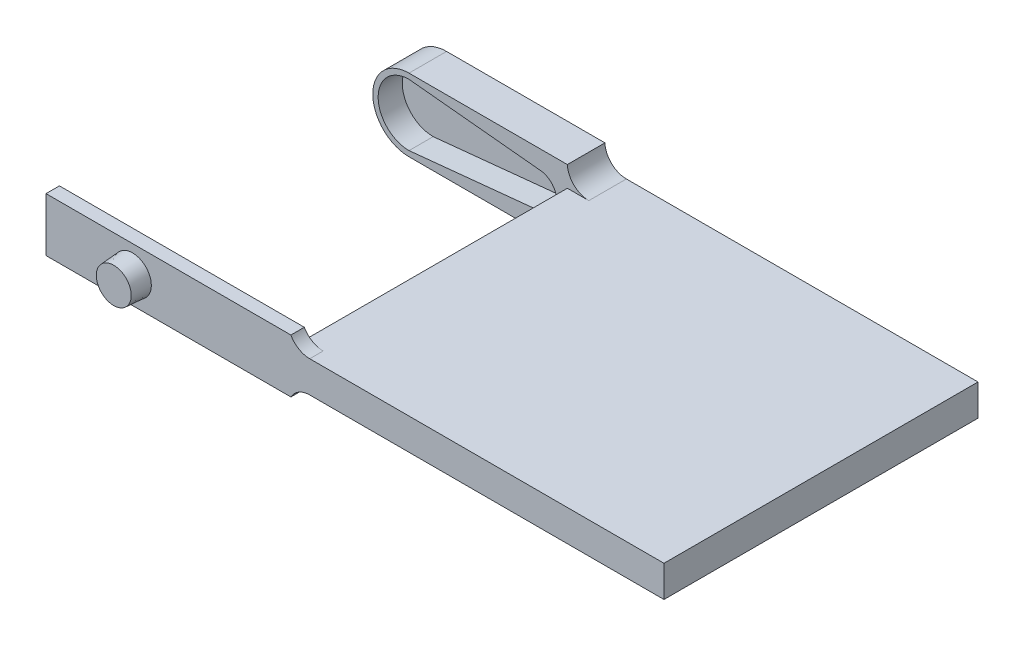
ISO-10303-21;
HEADER;
FILE_DESCRIPTION(('STEP AP214'),'2;1');
FILE_NAME('part.step','',(''),(''),'','','');
FILE_SCHEMA(('AUTOMOTIVE_DESIGN { 1 0 10303 214 1 1 1 1 }'));
ENDSEC;
DATA;
#1=APPLICATION_CONTEXT('core data for automotive mechanical design processes');
#2=APPLICATION_PROTOCOL_DEFINITION('international standard','automotive_design',2000,#1);
#3=PRODUCT_CONTEXT('',#1,'mechanical');
#4=PRODUCT('Part','Part','',(#3));
#5=PRODUCT_RELATED_PRODUCT_CATEGORY('part','',(#4));
#6=PRODUCT_DEFINITION_FORMATION('','',#4);
#7=PRODUCT_DEFINITION_CONTEXT('part definition',#1,'design');
#8=PRODUCT_DEFINITION('design','',#6,#7);
#9=PRODUCT_DEFINITION_SHAPE('','',#8);
#10=(LENGTH_UNIT() NAMED_UNIT(*) SI_UNIT(.MILLI.,.METRE.));
#11=(NAMED_UNIT(*) PLANE_ANGLE_UNIT() SI_UNIT($,.RADIAN.));
#12=(NAMED_UNIT(*) SI_UNIT($,.STERADIAN.) SOLID_ANGLE_UNIT());
#13=UNCERTAINTY_MEASURE_WITH_UNIT(LENGTH_MEASURE(1.E-05),#10,'distance_accuracy_value','');
#14=(GEOMETRIC_REPRESENTATION_CONTEXT(3) GLOBAL_UNCERTAINTY_ASSIGNED_CONTEXT((#13)) GLOBAL_UNIT_ASSIGNED_CONTEXT((#10,
#11,#12)) REPRESENTATION_CONTEXT('',''));
#15=CARTESIAN_POINT('',(0.,0.,0.));
#16=DIRECTION('',(0.,0.,1.));
#17=DIRECTION('',(1.,0.,0.));
#18=AXIS2_PLACEMENT_3D('',#15,#16,#17);
#19=CARTESIAN_POINT('',(0.,0.,29.25));
#20=DIRECTION('',(0.,0.,-1.));
#21=DIRECTION('',(-1.,0.,0.));
#22=AXIS2_PLACEMENT_3D('',#19,#20,#21);
#23=PLANE('',#22);
#24=DIRECTION('',(-1.,0.,0.));
#25=VECTOR('',#24,1.);
#26=CARTESIAN_POINT('',(0.,4.83707186120483,29.25));
#27=LINE('',#26,#25);
#28=CARTESIAN_POINT('',(49.5,4.83707186120483,29.25));
#29=VERTEX_POINT('',#28);
#30=CARTESIAN_POINT('',(16.5034017605437,4.83707186120483,29.25));
#31=VERTEX_POINT('',#30);
#32=EDGE_CURVE('E244',#29,#31,#27,.T.);
#33=ORIENTED_EDGE('',*,*,#32,.T.);
#34=CARTESIAN_POINT('',(16.5034017605437,6.83707186120483,29.25));
#35=DIRECTION('',(0.,0.,-1.));
#36=DIRECTION('',(-1.,0.,0.));
#37=AXIS2_PLACEMENT_3D('',#34,#35,#36);
#38=CIRCLE('',#37,2.);
#39=CARTESIAN_POINT('',(14.75,5.875,29.25));
#40=VERTEX_POINT('',#39);
#41=EDGE_CURVE('E12',#31,#40,#38,.T.);
#42=ORIENTED_EDGE('',*,*,#41,.T.);
#43=DIRECTION('',(-1.,0.,0.));
#44=VECTOR('',#43,1.);
#45=CARTESIAN_POINT('',(13.5,5.875,29.25));
#46=LINE('',#45,#44);
#47=CARTESIAN_POINT('',(-8.06135668366892,5.875,29.25));
#48=VERTEX_POINT('',#47);
#49=EDGE_CURVE('E227',#40,#48,#46,.T.);
#50=ORIENTED_EDGE('',*,*,#49,.T.);
#51=DIRECTION('',(0.,-1.,0.));
#52=VECTOR('',#51,1.);
#53=CARTESIAN_POINT('',(-8.06135668366892,5.875,29.25));
#54=LINE('',#53,#52);
#55=CARTESIAN_POINT('',(-8.06135668366892,0.875000000000004,29.25));
#56=VERTEX_POINT('',#55);
#57=EDGE_CURVE('E713',#48,#56,#54,.T.);
#58=ORIENTED_EDGE('',*,*,#57,.T.);
#59=DIRECTION('',(-1.,0.,0.));
#60=VECTOR('',#59,1.);
#61=CARTESIAN_POINT('',(14.75,0.875000000000004,29.25));
#62=LINE('',#61,#60);
#63=CARTESIAN_POINT('',(14.75,0.875000000000004,29.25));
#64=VERTEX_POINT('',#63);
#65=EDGE_CURVE('E386',#64,#56,#62,.T.);
#66=ORIENTED_EDGE('',*,*,#65,.F.);
#67=CARTESIAN_POINT('',(16.5034017605437,-0.0870718612048299,29.25));
#68=DIRECTION('',(0.,0.,-1.));
#69=DIRECTION('',(-1.,0.,0.));
#70=AXIS2_PLACEMENT_3D('',#67,#68,#69);
#71=CIRCLE('',#70,2.);
#72=CARTESIAN_POINT('',(16.5034017605437,1.91292813879517,29.25));
#73=VERTEX_POINT('',#72);
#74=EDGE_CURVE('E218',#64,#73,#71,.T.);
#75=ORIENTED_EDGE('',*,*,#74,.T.);
#76=DIRECTION('',(-1.,0.,0.));
#77=VECTOR('',#76,1.);
#78=CARTESIAN_POINT('',(0.,1.91292813879517,29.25));
#79=LINE('',#78,#77);
#80=CARTESIAN_POINT('',(49.5,1.91292813879517,29.25));
#81=VERTEX_POINT('',#80);
#82=EDGE_CURVE('E241',#81,#73,#79,.T.);
#83=ORIENTED_EDGE('',*,*,#82,.F.);
#84=DIRECTION('',(0.,1.,0.));
#85=VECTOR('',#84,1.);
#86=CARTESIAN_POINT('',(49.5,0.,29.25));
#87=LINE('',#86,#85);
#88=EDGE_CURVE('E248',#81,#29,#87,.T.);
#89=ORIENTED_EDGE('',*,*,#88,.T.);
#90=EDGE_LOOP('',(#33,#42,#50,#58,#66,#75,#83,#89));
#91=FACE_BOUND('',#90,.T.);
#92=CARTESIAN_POINT('',(0.,3.375,29.25));
#93=DIRECTION('',(0.,0.,-1.));
#94=DIRECTION('',(-1.,0.,0.));
#95=AXIS2_PLACEMENT_3D('',#92,#93,#94);
#96=CIRCLE('',#95,1.75);
#97=CARTESIAN_POINT('',(-1.75,3.375,29.25));
#98=VERTEX_POINT('',#97);
#99=EDGE_CURVE('E343',#98,#98,#96,.F.);
#100=ORIENTED_EDGE('',*,*,#99,.F.);
#101=EDGE_LOOP('',(#100));
#102=FACE_BOUND('',#101,.T.);
#103=ADVANCED_FACE('F57',(#91,#102),#23,.F.);
#104=CARTESIAN_POINT('',(0.,6.75,3.5));
#105=DIRECTION('',(0.,1.,0.));
#106=DIRECTION('',(0.,0.,1.));
#107=AXIS2_PLACEMENT_3D('',#104,#105,#106);
#108=PLANE('',#107);
#109=DIRECTION('',(1.,0.,0.));
#110=VECTOR('',#109,1.);
#111=CARTESIAN_POINT('',(0.,6.75,0.));
#112=LINE('',#111,#110);
#113=CARTESIAN_POINT('',(0.,6.75,0.));
#114=VERTEX_POINT('',#113);
#115=CARTESIAN_POINT('',(14.75,6.75,0.));
#116=VERTEX_POINT('',#115);
#117=EDGE_CURVE('E323',#114,#116,#112,.T.);
#118=ORIENTED_EDGE('',*,*,#117,.F.);
#119=DIRECTION('',(0.,0.,-1.));
#120=VECTOR('',#119,1.);
#121=CARTESIAN_POINT('',(0.,6.75,3.5));
#122=LINE('',#121,#120);
#123=CARTESIAN_POINT('',(0.,6.75,3.5));
#124=VERTEX_POINT('',#123);
#125=EDGE_CURVE('E341',#124,#114,#122,.T.);
#126=ORIENTED_EDGE('',*,*,#125,.F.);
#127=DIRECTION('',(1.,0.,0.));
#128=VECTOR('',#127,1.);
#129=CARTESIAN_POINT('',(0.,6.75,3.5));
#130=LINE('',#129,#128);
#131=CARTESIAN_POINT('',(14.75,6.75,3.5));
#132=VERTEX_POINT('',#131);
#133=EDGE_CURVE('E308',#124,#132,#130,.T.);
#134=ORIENTED_EDGE('',*,*,#133,.T.);
#135=DIRECTION('',(0.,0.,-1.));
#136=VECTOR('',#135,1.);
#137=CARTESIAN_POINT('',(14.75,6.75,3.5));
#138=LINE('',#137,#136);
#139=EDGE_CURVE('E331',#132,#116,#138,.T.);
#140=ORIENTED_EDGE('',*,*,#139,.T.);
#141=EDGE_LOOP('',(#118,#126,#134,#140));
#142=FACE_BOUND('',#141,.T.);
#143=ADVANCED_FACE('F406',(#142),#108,.T.);
#144=CARTESIAN_POINT('',(0.,3.375,3.5));
#145=DIRECTION('',(0.,0.,-1.));
#146=DIRECTION('',(-1.,0.,0.));
#147=AXIS2_PLACEMENT_3D('',#144,#145,#146);
#148=CYLINDRICAL_SURFACE('',#147,3.375);
#149=CARTESIAN_POINT('',(0.,3.375,0.));
#150=DIRECTION('',(0.,0.,1.));
#151=DIRECTION('',(1.,0.,0.));
#152=AXIS2_PLACEMENT_3D('',#149,#150,#151);
#153=CIRCLE('',#152,3.375);
#154=CARTESIAN_POINT('',(0.,0.,0.));
#155=VERTEX_POINT('',#154);
#156=EDGE_CURVE('E326',#114,#155,#153,.T.);
#157=ORIENTED_EDGE('',*,*,#156,.T.);
#158=DIRECTION('',(0.,0.,-1.));
#159=VECTOR('',#158,1.);
#160=CARTESIAN_POINT('',(0.,0.,3.5));
#161=LINE('',#160,#159);
#162=CARTESIAN_POINT('',(0.,0.,3.5));
#163=VERTEX_POINT('',#162);
#164=EDGE_CURVE('E338',#163,#155,#161,.T.);
#165=ORIENTED_EDGE('',*,*,#164,.F.);
#166=CARTESIAN_POINT('',(0.,3.375,3.5));
#167=DIRECTION('',(0.,0.,1.));
#168=DIRECTION('',(1.,0.,0.));
#169=AXIS2_PLACEMENT_3D('',#166,#167,#168);
#170=CIRCLE('',#169,3.375);
#171=EDGE_CURVE('E311',#124,#163,#170,.T.);
#172=ORIENTED_EDGE('',*,*,#171,.F.);
#173=ORIENTED_EDGE('',*,*,#125,.T.);
#174=EDGE_LOOP('',(#157,#165,#172,#173));
#175=FACE_BOUND('',#174,.T.);
#176=ADVANCED_FACE('F411',(#175),#148,.T.);
#177=CARTESIAN_POINT('',(0.,0.,3.5));
#178=DIRECTION('',(0.,1.,0.));
#179=DIRECTION('',(0.,0.,1.));
#180=AXIS2_PLACEMENT_3D('',#177,#178,#179);
#181=PLANE('',#180);
#182=DIRECTION('',(1.,0.,0.));
#183=VECTOR('',#182,1.);
#184=CARTESIAN_POINT('',(0.,0.,0.));
#185=LINE('',#184,#183);
#186=CARTESIAN_POINT('',(14.75,0.,0.));
#187=VERTEX_POINT('',#186);
#188=EDGE_CURVE('E301',#155,#187,#185,.T.);
#189=ORIENTED_EDGE('',*,*,#188,.T.);
#190=DIRECTION('',(0.,0.,-1.));
#191=VECTOR('',#190,1.);
#192=CARTESIAN_POINT('',(14.75,0.,3.5));
#193=LINE('',#192,#191);
#194=CARTESIAN_POINT('',(14.75,0.,3.5));
#195=VERTEX_POINT('',#194);
#196=EDGE_CURVE('E334',#195,#187,#193,.T.);
#197=ORIENTED_EDGE('',*,*,#196,.F.);
#198=DIRECTION('',(1.,0.,0.));
#199=VECTOR('',#198,1.);
#200=CARTESIAN_POINT('',(0.,0.,3.5));
#201=LINE('',#200,#199);
#202=EDGE_CURVE('E314',#163,#195,#201,.T.);
#203=ORIENTED_EDGE('',*,*,#202,.F.);
#204=ORIENTED_EDGE('',*,*,#164,.T.);
#205=EDGE_LOOP('',(#189,#197,#203,#204));
#206=FACE_BOUND('',#205,.T.);
#207=ADVANCED_FACE('F453',(#206),#181,.F.);
#208=CARTESIAN_POINT('',(0.,3.375,3.5));
#209=DIRECTION('',(0.,0.,-1.));
#210=DIRECTION('',(-1.,0.,0.));
#211=AXIS2_PLACEMENT_3D('',#208,#209,#210);
#212=CYLINDRICAL_SURFACE('',#211,2.875);
#213=DIRECTION('',(0.,0.,-1.));
#214=VECTOR('',#213,1.);
#215=CARTESIAN_POINT('',(-0.572386969683342,6.19244532456918,1.25));
#216=LINE('',#215,#214);
#217=CARTESIAN_POINT('',(-0.572386969683342,6.19244532456918,1.25));
#218=VERTEX_POINT('',#217);
#219=CARTESIAN_POINT('',(-0.572386969683342,6.19244532456918,0.));
#220=VERTEX_POINT('',#219);
#221=EDGE_CURVE('E290',#218,#220,#216,.T.);
#222=ORIENTED_EDGE('',*,*,#221,.T.);
#223=CARTESIAN_POINT('',(0.,3.375,0.));
#224=DIRECTION('',(0.,0.,1.));
#225=DIRECTION('',(1.,0.,0.));
#226=AXIS2_PLACEMENT_3D('',#223,#224,#225);
#227=CIRCLE('',#226,2.875);
#228=CARTESIAN_POINT('',(0.,6.25,0.));
#229=VERTEX_POINT('',#228);
#230=EDGE_CURVE('E320',#229,#220,#227,.T.);
#231=ORIENTED_EDGE('',*,*,#230,.F.);
#232=DIRECTION('',(0.,0.,-1.));
#233=VECTOR('',#232,1.);
#234=CARTESIAN_POINT('',(0.,6.25,1.25));
#235=LINE('',#234,#233);
#236=CARTESIAN_POINT('',(0.,6.25,1.25));
#237=VERTEX_POINT('',#236);
#238=EDGE_CURVE('E293',#237,#229,#235,.T.);
#239=ORIENTED_EDGE('',*,*,#238,.F.);
#240=DIRECTION('',(0.,0.,-1.));
#241=VECTOR('',#240,1.);
#242=CARTESIAN_POINT('',(0.,6.25,3.5));
#243=LINE('',#242,#241);
#244=CARTESIAN_POINT('',(0.,6.25,3.5));
#245=VERTEX_POINT('',#244);
#246=EDGE_CURVE('E335',#245,#237,#243,.T.);
#247=ORIENTED_EDGE('',*,*,#246,.F.);
#248=CARTESIAN_POINT('',(0.,3.375,3.5));
#249=DIRECTION('',(0.,0.,1.));
#250=DIRECTION('',(1.,0.,0.));
#251=AXIS2_PLACEMENT_3D('',#248,#249,#250);
#252=CIRCLE('',#251,2.875);
#253=CARTESIAN_POINT('',(0.,0.499999999999999,3.5));
#254=VERTEX_POINT('',#253);
#255=EDGE_CURVE('E297',#245,#254,#252,.T.);
#256=ORIENTED_EDGE('',*,*,#255,.T.);
#257=DIRECTION('',(0.,0.,-1.));
#258=VECTOR('',#257,1.);
#259=CARTESIAN_POINT('',(0.,0.499999999999999,3.5));
#260=LINE('',#259,#258);
#261=CARTESIAN_POINT('',(0.,0.499999999999999,1.25));
#262=VERTEX_POINT('',#261);
#263=EDGE_CURVE('E319',#254,#262,#260,.T.);
#264=ORIENTED_EDGE('',*,*,#263,.T.);
#265=DIRECTION('',(0.,0.,-1.));
#266=VECTOR('',#265,1.);
#267=CARTESIAN_POINT('',(0.,0.499999999999999,1.25));
#268=LINE('',#267,#266);
#269=CARTESIAN_POINT('',(0.,0.499999999999999,0.));
#270=VERTEX_POINT('',#269);
#271=EDGE_CURVE('E280',#262,#270,#268,.T.);
#272=ORIENTED_EDGE('',*,*,#271,.T.);
#273=CARTESIAN_POINT('',(-0.572386969683347,0.557554675430822,0.));
#274=VERTEX_POINT('',#273);
#275=EDGE_CURVE('E296',#274,#270,#227,.T.);
#276=ORIENTED_EDGE('',*,*,#275,.F.);
#277=DIRECTION('',(0.,0.,-1.));
#278=VECTOR('',#277,1.);
#279=CARTESIAN_POINT('',(-0.57238696968335,0.557554675430823,1.25));
#280=LINE('',#279,#278);
#281=CARTESIAN_POINT('',(-0.57238696968335,0.557554675430823,1.25));
#282=VERTEX_POINT('',#281);
#283=EDGE_CURVE('E287',#282,#274,#280,.T.);
#284=ORIENTED_EDGE('',*,*,#283,.F.);
#285=CARTESIAN_POINT('',(0.,3.375,1.25));
#286=DIRECTION('',(0.,0.,1.));
#287=DIRECTION('',(1.,0.,0.));
#288=AXIS2_PLACEMENT_3D('',#285,#286,#287);
#289=CIRCLE('',#288,2.875);
#290=EDGE_CURVE('E273',#218,#282,#289,.T.);
#291=ORIENTED_EDGE('',*,*,#290,.F.);
#292=EDGE_LOOP('',(#222,#231,#239,#247,#256,#264,#272,#276,#284,#291));
#293=FACE_BOUND('',#292,.T.);
#294=ADVANCED_FACE('F456',(#293),#212,.F.);
#295=CARTESIAN_POINT('',(0.622159749655816,6.18744057018389,3.5));
#296=DIRECTION('',(-0.100047532556171,-0.994982658758142,0.));
#297=DIRECTION('',(0.994982658758142,-0.100047532556171,0.));
#298=AXIS2_PLACEMENT_3D('',#295,#296,#297);
#299=PLANE('',#298);
#300=DIRECTION('',(-0.994982658758143,0.100047532556171,0.));
#301=VECTOR('',#300,1.);
#302=CARTESIAN_POINT('',(0.622159749655816,6.18744057018389,1.25));
#303=LINE('',#302,#301);
#304=CARTESIAN_POINT('',(12.2650784287177,5.01672138695093,1.25));
#305=VERTEX_POINT('',#304);
#306=EDGE_CURVE('E266',#305,#237,#303,.T.);
#307=ORIENTED_EDGE('',*,*,#306,.F.);
#308=DIRECTION('',(0.,0.,-1.));
#309=VECTOR('',#308,1.);
#310=CARTESIAN_POINT('',(12.2650784287177,5.01672138695093,3.5));
#311=LINE('',#310,#309);
#312=CARTESIAN_POINT('',(12.2650784287177,5.01672138695093,3.5));
#313=VERTEX_POINT('',#312);
#314=EDGE_CURVE('E349',#313,#305,#311,.T.);
#315=ORIENTED_EDGE('',*,*,#314,.F.);
#316=DIRECTION('',(-0.994982658758143,0.100047532556171,0.));
#317=VECTOR('',#316,1.);
#318=CARTESIAN_POINT('',(0.622159749655816,6.18744057018389,3.5));
#319=LINE('',#318,#317);
#320=EDGE_CURVE('E300',#313,#245,#319,.T.);
#321=ORIENTED_EDGE('',*,*,#320,.T.);
#322=ORIENTED_EDGE('',*,*,#246,.T.);
#323=EDGE_LOOP('',(#307,#315,#321,#322));
#324=FACE_BOUND('',#323,.T.);
#325=ADVANCED_FACE('F467',(#324),#299,.T.);
#326=CARTESIAN_POINT('',(12.1,3.375,3.5));
#327=DIRECTION('',(0.,0.,-1.));
#328=DIRECTION('',(-1.,0.,0.));
#329=AXIS2_PLACEMENT_3D('',#326,#327,#328);
#330=CYLINDRICAL_SURFACE('',#329,1.64999999999999);
#331=ORIENTED_EDGE('',*,*,#314,.T.);
#332=CARTESIAN_POINT('',(12.1,3.375,1.25));
#333=DIRECTION('',(0.,0.,1.));
#334=DIRECTION('',(1.,0.,0.));
#335=AXIS2_PLACEMENT_3D('',#332,#333,#334);
#336=CIRCLE('',#335,1.64999999999999);
#337=CARTESIAN_POINT('',(12.2650784287177,1.73327861304907,1.25));
#338=VERTEX_POINT('',#337);
#339=EDGE_CURVE('E264',#305,#338,#336,.F.);
#340=ORIENTED_EDGE('',*,*,#339,.T.);
#341=DIRECTION('',(0.,0.,-1.));
#342=VECTOR('',#341,1.);
#343=CARTESIAN_POINT('',(12.2650784287177,1.73327861304907,3.5));
#344=LINE('',#343,#342);
#345=CARTESIAN_POINT('',(12.2650784287177,1.73327861304907,3.5));
#346=VERTEX_POINT('',#345);
#347=EDGE_CURVE('E346',#346,#338,#344,.T.);
#348=ORIENTED_EDGE('',*,*,#347,.F.);
#349=CARTESIAN_POINT('',(12.1,3.375,3.5));
#350=DIRECTION('',(0.,0.,1.));
#351=DIRECTION('',(1.,0.,0.));
#352=AXIS2_PLACEMENT_3D('',#349,#350,#351);
#353=CIRCLE('',#352,1.64999999999999);
#354=EDGE_CURVE('E304',#313,#346,#353,.F.);
#355=ORIENTED_EDGE('',*,*,#354,.F.);
#356=EDGE_LOOP('',(#331,#340,#348,#355));
#357=FACE_BOUND('',#356,.T.);
#358=ADVANCED_FACE('F463',(#357),#330,.F.);
#359=CARTESIAN_POINT('',(-0.0497727799724653,0.49499524561471,3.5));
#360=DIRECTION('',(0.100047532556171,-0.994982658758142,0.));
#361=DIRECTION('',(0.994982658758143,0.100047532556171,0.));
#362=AXIS2_PLACEMENT_3D('',#359,#360,#361);
#363=PLANE('',#362);
#364=ORIENTED_EDGE('',*,*,#347,.T.);
#365=DIRECTION('',(-0.994982658758142,-0.100047532556171,0.));
#366=VECTOR('',#365,1.);
#367=CARTESIAN_POINT('',(-0.0497727799724653,0.49499524561471,1.25));
#368=LINE('',#367,#366);
#369=EDGE_CURVE('E278',#338,#262,#368,.T.);
#370=ORIENTED_EDGE('',*,*,#369,.T.);
#371=ORIENTED_EDGE('',*,*,#263,.F.);
#372=DIRECTION('',(-0.994982658758142,-0.100047532556171,0.));
#373=VECTOR('',#372,1.);
#374=CARTESIAN_POINT('',(-0.0497727799724653,0.49499524561471,3.5));
#375=LINE('',#374,#373);
#376=EDGE_CURVE('E306',#346,#254,#375,.T.);
#377=ORIENTED_EDGE('',*,*,#376,.F.);
#378=EDGE_LOOP('',(#364,#370,#371,#377));
#379=FACE_BOUND('',#378,.T.);
#380=ADVANCED_FACE('F448',(#379),#363,.F.);
#381=CARTESIAN_POINT('',(0.,0.,3.5));
#382=DIRECTION('',(0.,0.,1.));
#383=DIRECTION('',(1.,0.,0.));
#384=AXIS2_PLACEMENT_3D('',#381,#382,#383);
#385=PLANE('',#384);
#386=ORIENTED_EDGE('',*,*,#255,.F.);
#387=ORIENTED_EDGE('',*,*,#320,.F.);
#388=ORIENTED_EDGE('',*,*,#354,.T.);
#389=ORIENTED_EDGE('',*,*,#376,.T.);
#390=EDGE_LOOP('',(#386,#387,#388,#389));
#391=FACE_BOUND('',#390,.T.);
#392=ORIENTED_EDGE('',*,*,#133,.F.);
#393=ORIENTED_EDGE('',*,*,#171,.T.);
#394=ORIENTED_EDGE('',*,*,#202,.T.);
#395=CARTESIAN_POINT('',(16.7481037237807,-0.0870718612048299,3.5));
#396=DIRECTION('',(0.,0.,1.));
#397=DIRECTION('',(1.,0.,0.));
#398=AXIS2_PLACEMENT_3D('',#395,#396,#397);
#399=CIRCLE('',#398,2.);
#400=CARTESIAN_POINT('',(16.7481037237807,1.91292813879517,3.5));
#401=VERTEX_POINT('',#400);
#402=EDGE_CURVE('E371',#195,#401,#399,.F.);
#403=ORIENTED_EDGE('',*,*,#402,.T.);
#404=DIRECTION('',(1.,0.,0.));
#405=VECTOR('',#404,1.);
#406=CARTESIAN_POINT('',(0.,1.91292813879517,3.5));
#407=LINE('',#406,#405);
#408=CARTESIAN_POINT('',(14.75,1.91292813879517,3.5));
#409=VERTEX_POINT('',#408);
#410=EDGE_CURVE('E80',#409,#401,#407,.T.);
#411=ORIENTED_EDGE('',*,*,#410,.F.);
#412=DIRECTION('',(0.,-1.,0.));
#413=VECTOR('',#412,1.);
#414=CARTESIAN_POINT('',(14.75,0.,3.5));
#415=LINE('',#414,#413);
#416=CARTESIAN_POINT('',(14.75,4.83707186120483,3.5));
#417=VERTEX_POINT('',#416);
#418=EDGE_CURVE('E316',#417,#409,#415,.T.);
#419=ORIENTED_EDGE('',*,*,#418,.F.);
#420=DIRECTION('',(-1.,0.,0.));
#421=VECTOR('',#420,1.);
#422=CARTESIAN_POINT('',(0.,4.83707186120483,3.5));
#423=LINE('',#422,#421);
#424=CARTESIAN_POINT('',(16.7481037237807,4.83707186120483,3.5));
#425=VERTEX_POINT('',#424);
#426=EDGE_CURVE('E364',#425,#417,#423,.T.);
#427=ORIENTED_EDGE('',*,*,#426,.F.);
#428=CARTESIAN_POINT('',(16.7481037237807,6.83707186120483,3.5));
#429=DIRECTION('',(0.,0.,1.));
#430=DIRECTION('',(1.,0.,0.));
#431=AXIS2_PLACEMENT_3D('',#428,#429,#430);
#432=CIRCLE('',#431,2.);
#433=EDGE_CURVE('E375',#425,#132,#432,.F.);
#434=ORIENTED_EDGE('',*,*,#433,.T.);
#435=EDGE_LOOP('',(#392,#393,#394,#403,#411,#419,#427,#434));
#436=FACE_BOUND('',#435,.T.);
#437=ADVANCED_FACE('F445',(#391,#436),#385,.T.);
#438=CARTESIAN_POINT('',(0.,0.,0.));
#439=DIRECTION('',(0.,0.,1.));
#440=DIRECTION('',(1.,0.,0.));
#441=AXIS2_PLACEMENT_3D('',#438,#439,#440);
#442=PLANE('',#441);
#443=DIRECTION('',(0.994982658758143,0.100047532556171,0.));
#444=VECTOR('',#443,1.);
#445=CARTESIAN_POINT('',(-0.622159749655816,6.18744057018389,0.));
#446=LINE('',#445,#444);
#447=EDGE_CURVE('E263',#220,#229,#446,.T.);
#448=ORIENTED_EDGE('',*,*,#447,.T.);
#449=ORIENTED_EDGE('',*,*,#230,.T.);
#450=EDGE_LOOP('',(#448,#449));
#451=FACE_BOUND('',#450,.T.);
#452=DIRECTION('',(0.994982658758142,-0.10004753255617,0.));
#453=VECTOR('',#452,1.);
#454=CARTESIAN_POINT('',(0.0497727799724651,0.494995245614711,0.));
#455=LINE('',#454,#453);
#456=EDGE_CURVE('E267',#274,#270,#455,.T.);
#457=ORIENTED_EDGE('',*,*,#456,.F.);
#458=ORIENTED_EDGE('',*,*,#275,.T.);
#459=EDGE_LOOP('',(#457,#458));
#460=FACE_BOUND('',#459,.T.);
#461=ORIENTED_EDGE('',*,*,#117,.T.);
#462=CARTESIAN_POINT('',(16.7481037237807,6.83707186120483,0.));
#463=DIRECTION('',(0.,0.,1.));
#464=DIRECTION('',(1.,0.,0.));
#465=AXIS2_PLACEMENT_3D('',#462,#463,#464);
#466=CIRCLE('',#465,2.);
#467=CARTESIAN_POINT('',(16.7481037237807,4.83707186120483,0.));
#468=VERTEX_POINT('',#467);
#469=EDGE_CURVE('E373',#116,#468,#466,.T.);
#470=ORIENTED_EDGE('',*,*,#469,.T.);
#471=DIRECTION('',(1.,0.,0.));
#472=VECTOR('',#471,1.);
#473=CARTESIAN_POINT('',(0.,4.83707186120483,0.));
#474=LINE('',#473,#472);
#475=CARTESIAN_POINT('',(49.5,4.83707186120483,0.));
#476=VERTEX_POINT('',#475);
#477=EDGE_CURVE('E232',#468,#476,#474,.T.);
#478=ORIENTED_EDGE('',*,*,#477,.T.);
#479=DIRECTION('',(0.,-1.,0.));
#480=VECTOR('',#479,1.);
#481=CARTESIAN_POINT('',(49.5,0.,0.));
#482=LINE('',#481,#480);
#483=CARTESIAN_POINT('',(49.5,1.91292813879517,0.));
#484=VERTEX_POINT('',#483);
#485=EDGE_CURVE('E249',#476,#484,#482,.T.);
#486=ORIENTED_EDGE('',*,*,#485,.T.);
#487=DIRECTION('',(1.,0.,0.));
#488=VECTOR('',#487,1.);
#489=CARTESIAN_POINT('',(0.,1.91292813879517,0.));
#490=LINE('',#489,#488);
#491=CARTESIAN_POINT('',(16.7481037237807,1.91292813879517,0.));
#492=VERTEX_POINT('',#491);
#493=EDGE_CURVE('E235',#492,#484,#490,.T.);
#494=ORIENTED_EDGE('',*,*,#493,.F.);
#495=CARTESIAN_POINT('',(16.7481037237807,-0.0870718612048299,0.));
#496=DIRECTION('',(0.,0.,1.));
#497=DIRECTION('',(1.,0.,0.));
#498=AXIS2_PLACEMENT_3D('',#495,#496,#497);
#499=CIRCLE('',#498,2.);
#500=EDGE_CURVE('E369',#492,#187,#499,.T.);
#501=ORIENTED_EDGE('',*,*,#500,.T.);
#502=ORIENTED_EDGE('',*,*,#188,.F.);
#503=ORIENTED_EDGE('',*,*,#156,.F.);
#504=EDGE_LOOP('',(#461,#470,#478,#486,#494,#501,#502,#503));
#505=FACE_BOUND('',#504,.T.);
#506=ADVANCED_FACE('F443',(#451,#460,#505),#442,.F.);
#507=CARTESIAN_POINT('',(-0.622159749655816,6.18744057018389,1.25));
#508=DIRECTION('',(-0.100047532556171,0.994982658758142,0.));
#509=DIRECTION('',(-0.994982658758143,-0.100047532556171,0.));
#510=AXIS2_PLACEMENT_3D('',#507,#508,#509);
#511=PLANE('',#510);
#512=ORIENTED_EDGE('',*,*,#447,.F.);
#513=ORIENTED_EDGE('',*,*,#221,.F.);
#514=DIRECTION('',(0.994982658758143,0.100047532556171,0.));
#515=VECTOR('',#514,1.);
#516=CARTESIAN_POINT('',(-0.622159749655816,6.18744057018389,1.25));
#517=LINE('',#516,#515);
#518=EDGE_CURVE('E270',#218,#237,#517,.T.);
#519=ORIENTED_EDGE('',*,*,#518,.T.);
#520=ORIENTED_EDGE('',*,*,#238,.T.);
#521=EDGE_LOOP('',(#512,#513,#519,#520));
#522=FACE_BOUND('',#521,.T.);
#523=ADVANCED_FACE('F439',(#522),#511,.T.);
#524=CARTESIAN_POINT('',(0.0497727799724651,0.494995245614711,1.25));
#525=DIRECTION('',(0.10004753255617,0.994982658758143,0.));
#526=DIRECTION('',(-0.994982658758143,0.10004753255617,0.));
#527=AXIS2_PLACEMENT_3D('',#524,#525,#526);
#528=PLANE('',#527);
#529=ORIENTED_EDGE('',*,*,#456,.T.);
#530=ORIENTED_EDGE('',*,*,#271,.F.);
#531=DIRECTION('',(0.994982658758142,-0.10004753255617,0.));
#532=VECTOR('',#531,1.);
#533=CARTESIAN_POINT('',(0.0497727799724651,0.494995245614711,1.25));
#534=LINE('',#533,#532);
#535=EDGE_CURVE('E275',#282,#262,#534,.T.);
#536=ORIENTED_EDGE('',*,*,#535,.F.);
#537=ORIENTED_EDGE('',*,*,#283,.T.);
#538=EDGE_LOOP('',(#529,#530,#536,#537));
#539=FACE_BOUND('',#538,.T.);
#540=ADVANCED_FACE('F435',(#539),#528,.F.);
#541=CARTESIAN_POINT('',(0.,0.,1.25));
#542=DIRECTION('',(0.,0.,1.));
#543=DIRECTION('',(1.,0.,0.));
#544=AXIS2_PLACEMENT_3D('',#541,#542,#543);
#545=PLANE('',#544);
#546=ORIENTED_EDGE('',*,*,#339,.F.);
#547=ORIENTED_EDGE('',*,*,#306,.T.);
#548=ORIENTED_EDGE('',*,*,#518,.F.);
#549=ORIENTED_EDGE('',*,*,#290,.T.);
#550=ORIENTED_EDGE('',*,*,#535,.T.);
#551=ORIENTED_EDGE('',*,*,#369,.F.);
#552=EDGE_LOOP('',(#546,#547,#548,#549,#550,#551));
#553=FACE_BOUND('',#552,.T.);
#554=ADVANCED_FACE('F428',(#553),#545,.T.);
#555=CARTESIAN_POINT('',(14.75,0.,64.1228134297953));
#556=DIRECTION('',(1.,0.,0.));
#557=DIRECTION('',(0.,1.,0.));
#558=AXIS2_PLACEMENT_3D('',#555,#556,#557);
#559=PLANE('',#558);
#560=DIRECTION('',(0.,0.,-1.));
#561=VECTOR('',#560,1.);
#562=CARTESIAN_POINT('',(14.75,1.91292813879517,64.1228134297953));
#563=LINE('',#562,#561);
#564=CARTESIAN_POINT('',(14.75,1.91292813879517,28.));
#565=VERTEX_POINT('',#564);
#566=EDGE_CURVE('E258',#565,#409,#563,.T.);
#567=ORIENTED_EDGE('',*,*,#566,.F.);
#568=DIRECTION('',(0.,-1.,0.));
#569=VECTOR('',#568,1.);
#570=CARTESIAN_POINT('',(14.75,5.875,28.));
#571=LINE('',#570,#569);
#572=CARTESIAN_POINT('',(14.75,4.83707186120483,28.));
#573=VERTEX_POINT('',#572);
#574=EDGE_CURVE('E226',#573,#565,#571,.T.);
#575=ORIENTED_EDGE('',*,*,#574,.F.);
#576=DIRECTION('',(0.,0.,-1.));
#577=VECTOR('',#576,1.);
#578=CARTESIAN_POINT('',(14.75,4.83707186120483,64.1228134297953));
#579=LINE('',#578,#577);
#580=EDGE_CURVE('E245',#573,#417,#579,.T.);
#581=ORIENTED_EDGE('',*,*,#580,.T.);
#582=ORIENTED_EDGE('',*,*,#418,.T.);
#583=EDGE_LOOP('',(#567,#575,#581,#582));
#584=FACE_BOUND('',#583,.T.);
#585=ADVANCED_FACE('F425',(#584),#559,.F.);
#586=CARTESIAN_POINT('',(0.,4.83707186120483,64.1228134297953));
#587=DIRECTION('',(0.,1.,0.));
#588=DIRECTION('',(0.,0.,1.));
#589=AXIS2_PLACEMENT_3D('',#586,#587,#588);
#590=PLANE('',#589);
#591=ORIENTED_EDGE('',*,*,#477,.F.);
#592=DIRECTION('',(0.,0.,-1.));
#593=VECTOR('',#592,1.);
#594=CARTESIAN_POINT('',(16.7481037237807,4.83707186120483,3.5));
#595=LINE('',#594,#593);
#596=EDGE_CURVE('E366',#468,#425,#595,.F.);
#597=ORIENTED_EDGE('',*,*,#596,.T.);
#598=ORIENTED_EDGE('',*,*,#426,.T.);
#599=ORIENTED_EDGE('',*,*,#580,.F.);
#600=DIRECTION('',(1.,0.,0.));
#601=VECTOR('',#600,1.);
#602=CARTESIAN_POINT('',(0.,4.83707186120483,28.));
#603=LINE('',#602,#601);
#604=CARTESIAN_POINT('',(16.5034017605437,4.83707186120483,28.));
#605=VERTEX_POINT('',#604);
#606=EDGE_CURVE('E72',#573,#605,#603,.T.);
#607=ORIENTED_EDGE('',*,*,#606,.T.);
#608=DIRECTION('',(0.,0.,1.));
#609=VECTOR('',#608,1.);
#610=CARTESIAN_POINT('',(16.5034017605437,4.83707186120483,29.25));
#611=LINE('',#610,#609);
#612=EDGE_CURVE('E217',#605,#31,#611,.T.);
#613=ORIENTED_EDGE('',*,*,#612,.T.);
#614=ORIENTED_EDGE('',*,*,#32,.F.);
#615=DIRECTION('',(0.,0.,-1.));
#616=VECTOR('',#615,1.);
#617=CARTESIAN_POINT('',(49.5,4.83707186120483,64.1228134297953));
#618=LINE('',#617,#616);
#619=EDGE_CURVE('E252',#29,#476,#618,.T.);
#620=ORIENTED_EDGE('',*,*,#619,.T.);
#621=EDGE_LOOP('',(#591,#597,#598,#599,#607,#613,#614,#620));
#622=FACE_BOUND('',#621,.T.);
#623=ADVANCED_FACE('F424',(#622),#590,.T.);
#624=CARTESIAN_POINT('',(0.,1.91292813879517,64.1228134297953));
#625=DIRECTION('',(0.,1.,0.));
#626=DIRECTION('',(0.,0.,1.));
#627=AXIS2_PLACEMENT_3D('',#624,#625,#626);
#628=PLANE('',#627);
#629=ORIENTED_EDGE('',*,*,#410,.T.);
#630=DIRECTION('',(0.,0.,1.));
#631=VECTOR('',#630,1.);
#632=CARTESIAN_POINT('',(16.7481037237807,1.91292813879517,64.1228134297953));
#633=LINE('',#632,#631);
#634=EDGE_CURVE('E360',#401,#492,#633,.F.);
#635=ORIENTED_EDGE('',*,*,#634,.T.);
#636=ORIENTED_EDGE('',*,*,#493,.T.);
#637=DIRECTION('',(0.,0.,-1.));
#638=VECTOR('',#637,1.);
#639=CARTESIAN_POINT('',(49.5,1.91292813879517,64.1228134297953));
#640=LINE('',#639,#638);
#641=EDGE_CURVE('E255',#81,#484,#640,.T.);
#642=ORIENTED_EDGE('',*,*,#641,.F.);
#643=ORIENTED_EDGE('',*,*,#82,.T.);
#644=DIRECTION('',(0.,0.,-1.));
#645=VECTOR('',#644,1.);
#646=CARTESIAN_POINT('',(16.5034017605437,1.91292813879517,64.1228134297953));
#647=LINE('',#646,#645);
#648=CARTESIAN_POINT('',(16.5034017605437,1.91292813879517,28.));
#649=VERTEX_POINT('',#648);
#650=EDGE_CURVE('E393',#73,#649,#647,.T.);
#651=ORIENTED_EDGE('',*,*,#650,.T.);
#652=DIRECTION('',(-1.,0.,0.));
#653=VECTOR('',#652,1.);
#654=CARTESIAN_POINT('',(0.,1.91292813879517,28.));
#655=LINE('',#654,#653);
#656=EDGE_CURVE('E397',#649,#565,#655,.T.);
#657=ORIENTED_EDGE('',*,*,#656,.T.);
#658=ORIENTED_EDGE('',*,*,#566,.T.);
#659=EDGE_LOOP('',(#629,#635,#636,#642,#643,#651,#657,#658));
#660=FACE_BOUND('',#659,.T.);
#661=ADVANCED_FACE('F392',(#660),#628,.F.);
#662=CARTESIAN_POINT('',(49.5,0.,64.1228134297953));
#663=DIRECTION('',(1.,0.,0.));
#664=DIRECTION('',(0.,0.,-1.));
#665=AXIS2_PLACEMENT_3D('',#662,#663,#664);
#666=PLANE('',#665);
#667=ORIENTED_EDGE('',*,*,#88,.F.);
#668=ORIENTED_EDGE('',*,*,#641,.T.);
#669=ORIENTED_EDGE('',*,*,#485,.F.);
#670=ORIENTED_EDGE('',*,*,#619,.F.);
#671=EDGE_LOOP('',(#667,#668,#669,#670));
#672=FACE_BOUND('',#671,.T.);
#673=ADVANCED_FACE('F418',(#672),#666,.T.);
#674=CARTESIAN_POINT('',(14.75,0.875000000000004,28.));
#675=DIRECTION('',(0.,1.,0.));
#676=DIRECTION('',(0.,0.,1.));
#677=AXIS2_PLACEMENT_3D('',#674,#675,#676);
#678=PLANE('',#677);
#679=ORIENTED_EDGE('',*,*,#65,.T.);
#680=DIRECTION('',(0.,0.,1.));
#681=VECTOR('',#680,1.);
#682=CARTESIAN_POINT('',(-8.06135668366892,0.875000000000004,28.));
#683=LINE('',#682,#681);
#684=CARTESIAN_POINT('',(-8.06135668366892,0.875000000000004,28.));
#685=VERTEX_POINT('',#684);
#686=EDGE_CURVE('E237',#685,#56,#683,.T.);
#687=ORIENTED_EDGE('',*,*,#686,.F.);
#688=DIRECTION('',(-1.,0.,0.));
#689=VECTOR('',#688,1.);
#690=CARTESIAN_POINT('',(14.75,0.875000000000004,28.));
#691=LINE('',#690,#689);
#692=CARTESIAN_POINT('',(14.75,0.875000000000004,28.));
#693=VERTEX_POINT('',#692);
#694=EDGE_CURVE('E720',#693,#685,#691,.T.);
#695=ORIENTED_EDGE('',*,*,#694,.F.);
#696=DIRECTION('',(0.,0.,1.));
#697=VECTOR('',#696,1.);
#698=CARTESIAN_POINT('',(14.75,0.875000000000004,28.));
#699=LINE('',#698,#697);
#700=EDGE_CURVE('E233',#693,#64,#699,.T.);
#701=ORIENTED_EDGE('',*,*,#700,.T.);
#702=EDGE_LOOP('',(#679,#687,#695,#701));
#703=FACE_BOUND('',#702,.T.);
#704=ADVANCED_FACE('F416',(#703),#678,.F.);
#705=CARTESIAN_POINT('',(-8.06135668366892,5.875,28.));
#706=DIRECTION('',(-1.,0.,0.));
#707=DIRECTION('',(0.,0.,1.));
#708=AXIS2_PLACEMENT_3D('',#705,#706,#707);
#709=PLANE('',#708);
#710=ORIENTED_EDGE('',*,*,#57,.F.);
#711=DIRECTION('',(0.,0.,1.));
#712=VECTOR('',#711,1.);
#713=CARTESIAN_POINT('',(-8.06135668366892,5.875,28.));
#714=LINE('',#713,#712);
#715=CARTESIAN_POINT('',(-8.06135668366892,5.875,28.));
#716=VERTEX_POINT('',#715);
#717=EDGE_CURVE('E714',#716,#48,#714,.T.);
#718=ORIENTED_EDGE('',*,*,#717,.F.);
#719=DIRECTION('',(0.,-1.,0.));
#720=VECTOR('',#719,1.);
#721=CARTESIAN_POINT('',(-8.06135668366892,5.875,28.));
#722=LINE('',#721,#720);
#723=EDGE_CURVE('E223',#716,#685,#722,.T.);
#724=ORIENTED_EDGE('',*,*,#723,.T.);
#725=ORIENTED_EDGE('',*,*,#686,.T.);
#726=EDGE_LOOP('',(#710,#718,#724,#725));
#727=FACE_BOUND('',#726,.T.);
#728=ADVANCED_FACE('F526',(#727),#709,.T.);
#729=CARTESIAN_POINT('',(13.5,5.875,28.));
#730=DIRECTION('',(0.,1.,0.));
#731=DIRECTION('',(-1.,0.,0.));
#732=AXIS2_PLACEMENT_3D('',#729,#730,#731);
#733=PLANE('',#732);
#734=ORIENTED_EDGE('',*,*,#49,.F.);
#735=DIRECTION('',(0.,0.,1.));
#736=VECTOR('',#735,1.);
#737=CARTESIAN_POINT('',(14.75,5.875,28.));
#738=LINE('',#737,#736);
#739=CARTESIAN_POINT('',(14.75,5.875,28.));
#740=VERTEX_POINT('',#739);
#741=EDGE_CURVE('E216',#740,#40,#738,.T.);
#742=ORIENTED_EDGE('',*,*,#741,.F.);
#743=DIRECTION('',(1.,0.,0.));
#744=VECTOR('',#743,1.);
#745=CARTESIAN_POINT('',(13.5,5.875,28.));
#746=LINE('',#745,#744);
#747=EDGE_CURVE('E220',#716,#740,#746,.T.);
#748=ORIENTED_EDGE('',*,*,#747,.F.);
#749=ORIENTED_EDGE('',*,*,#717,.T.);
#750=EDGE_LOOP('',(#734,#742,#748,#749));
#751=FACE_BOUND('',#750,.T.);
#752=ADVANCED_FACE('F230',(#751),#733,.T.);
#753=CARTESIAN_POINT('',(0.,0.,28.));
#754=DIRECTION('',(0.,0.,-1.));
#755=DIRECTION('',(-1.,0.,0.));
#756=AXIS2_PLACEMENT_3D('',#753,#754,#755);
#757=PLANE('',#756);
#758=ORIENTED_EDGE('',*,*,#747,.T.);
#759=CARTESIAN_POINT('',(16.5034017605437,6.83707186120483,28.));
#760=DIRECTION('',(0.,0.,-1.));
#761=DIRECTION('',(-1.,0.,0.));
#762=AXIS2_PLACEMENT_3D('',#759,#760,#761);
#763=CIRCLE('',#762,2.);
#764=EDGE_CURVE('E65',#740,#605,#763,.F.);
#765=ORIENTED_EDGE('',*,*,#764,.T.);
#766=ORIENTED_EDGE('',*,*,#606,.F.);
#767=ORIENTED_EDGE('',*,*,#574,.T.);
#768=ORIENTED_EDGE('',*,*,#656,.F.);
#769=CARTESIAN_POINT('',(16.5034017605437,-0.0870718612048299,28.));
#770=DIRECTION('',(0.,0.,-1.));
#771=DIRECTION('',(-1.,0.,0.));
#772=AXIS2_PLACEMENT_3D('',#769,#770,#771);
#773=CIRCLE('',#772,2.);
#774=EDGE_CURVE('E377',#649,#693,#773,.F.);
#775=ORIENTED_EDGE('',*,*,#774,.T.);
#776=ORIENTED_EDGE('',*,*,#694,.T.);
#777=ORIENTED_EDGE('',*,*,#723,.F.);
#778=EDGE_LOOP('',(#758,#765,#766,#767,#768,#775,#776,#777));
#779=FACE_BOUND('',#778,.T.);
#780=ADVANCED_FACE('F221',(#779),#757,.T.);
#781=CARTESIAN_POINT('',(0.,3.375,29.25));
#782=DIRECTION('',(0.,0.,-1.));
#783=DIRECTION('',(1.,0.,0.));
#784=AXIS2_PLACEMENT_3D('',#781,#782,#783);
#785=CONICAL_SURFACE('',#784,1.75,0.0698131700797732);
#786=CARTESIAN_POINT('',(0.,3.375,31.));
#787=DIRECTION('',(0.,0.,1.));
#788=DIRECTION('',(1.,0.,0.));
#789=AXIS2_PLACEMENT_3D('',#786,#787,#788);
#790=CIRCLE('',#789,1.62762807909886);
#791=CARTESIAN_POINT('',(1.62762807909886,3.375,31.));
#792=VERTEX_POINT('',#791);
#793=EDGE_CURVE('E724',#792,#792,#790,.T.);
#794=ORIENTED_EDGE('',*,*,#793,.F.);
#795=EDGE_LOOP('',(#794));
#796=FACE_BOUND('',#795,.T.);
#797=ORIENTED_EDGE('',*,*,#99,.T.);
#798=EDGE_LOOP('',(#797));
#799=FACE_BOUND('',#798,.T.);
#800=ADVANCED_FACE('F404',(#796,#799),#785,.T.);
#801=CARTESIAN_POINT('',(0.,3.375,31.));
#802=DIRECTION('',(0.,0.,1.));
#803=DIRECTION('',(1.,0.,0.));
#804=AXIS2_PLACEMENT_3D('',#801,#802,#803);
#805=PLANE('',#804);
#806=ORIENTED_EDGE('',*,*,#793,.T.);
#807=EDGE_LOOP('',(#806));
#808=FACE_BOUND('',#807,.T.);
#809=ADVANCED_FACE('F479',(#808),#805,.T.);
#810=CARTESIAN_POINT('',(16.7481037237807,-0.0870718612048299,3.5));
#811=DIRECTION('',(0.,0.,1.));
#812=DIRECTION('',(1.,0.,0.));
#813=AXIS2_PLACEMENT_3D('',#810,#811,#812);
#814=CYLINDRICAL_SURFACE('',#813,2.);
#815=ORIENTED_EDGE('',*,*,#402,.F.);
#816=ORIENTED_EDGE('',*,*,#196,.T.);
#817=ORIENTED_EDGE('',*,*,#500,.F.);
#818=ORIENTED_EDGE('',*,*,#634,.F.);
#819=EDGE_LOOP('',(#815,#816,#817,#818));
#820=FACE_BOUND('',#819,.T.);
#821=ADVANCED_FACE('F475',(#820),#814,.F.);
#822=CARTESIAN_POINT('',(16.7481037237807,6.83707186120483,3.5));
#823=DIRECTION('',(0.,0.,1.));
#824=DIRECTION('',(1.,0.,0.));
#825=AXIS2_PLACEMENT_3D('',#822,#823,#824);
#826=CYLINDRICAL_SURFACE('',#825,2.);
#827=ORIENTED_EDGE('',*,*,#433,.F.);
#828=ORIENTED_EDGE('',*,*,#596,.F.);
#829=ORIENTED_EDGE('',*,*,#469,.F.);
#830=ORIENTED_EDGE('',*,*,#139,.F.);
#831=EDGE_LOOP('',(#827,#828,#829,#830));
#832=FACE_BOUND('',#831,.T.);
#833=ADVANCED_FACE('F478',(#832),#826,.F.);
#834=CARTESIAN_POINT('',(16.5034017605437,-0.0870718612048299,28.));
#835=DIRECTION('',(0.,0.,-1.));
#836=DIRECTION('',(-1.,0.,0.));
#837=AXIS2_PLACEMENT_3D('',#834,#835,#836);
#838=CYLINDRICAL_SURFACE('',#837,2.);
#839=ORIENTED_EDGE('',*,*,#74,.F.);
#840=ORIENTED_EDGE('',*,*,#700,.F.);
#841=ORIENTED_EDGE('',*,*,#774,.F.);
#842=ORIENTED_EDGE('',*,*,#650,.F.);
#843=EDGE_LOOP('',(#839,#840,#841,#842));
#844=FACE_BOUND('',#843,.T.);
#845=ADVANCED_FACE('F395',(#844),#838,.F.);
#846=CARTESIAN_POINT('',(16.5034017605437,6.83707186120483,28.));
#847=DIRECTION('',(0.,0.,-1.));
#848=DIRECTION('',(-1.,0.,0.));
#849=AXIS2_PLACEMENT_3D('',#846,#847,#848);
#850=CYLINDRICAL_SURFACE('',#849,2.);
#851=ORIENTED_EDGE('',*,*,#41,.F.);
#852=ORIENTED_EDGE('',*,*,#612,.F.);
#853=ORIENTED_EDGE('',*,*,#764,.F.);
#854=ORIENTED_EDGE('',*,*,#741,.T.);
#855=EDGE_LOOP('',(#851,#852,#853,#854));
#856=FACE_BOUND('',#855,.T.);
#857=ADVANCED_FACE('F59',(#856),#850,.F.);
#858=CLOSED_SHELL('',(#103,#143,#176,#207,#294,#325,#358,#380,#437,#506,#523,#540,#554,#585,
#623,#661,#673,#704,#728,#752,#780,#800,#809,#821,#833,#845,#857));
#859=MANIFOLD_SOLID_BREP('B2',#858);
#860=ADVANCED_BREP_SHAPE_REPRESENTATION('',(#18,#859),#14);
#861=SHAPE_DEFINITION_REPRESENTATION(#9,#860);
ENDSEC;
END-ISO-10303-21;
